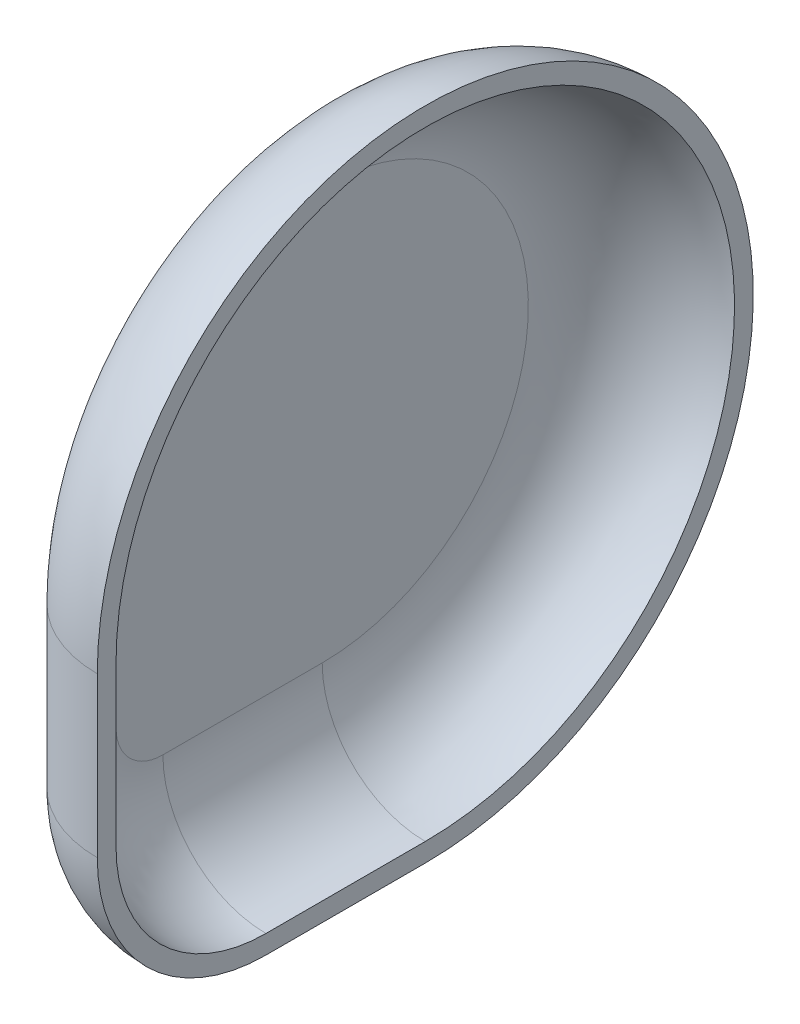
ISO-10303-21;
HEADER;
FILE_DESCRIPTION(('STEP AP214'),'2;1');
FILE_NAME('part.step','',(''),(''),'','','');
FILE_SCHEMA(('AUTOMOTIVE_DESIGN { 1 0 10303 214 1 1 1 1 }'));
ENDSEC;
DATA;
#1=APPLICATION_CONTEXT('core data for automotive mechanical design processes');
#2=APPLICATION_PROTOCOL_DEFINITION('international standard','automotive_design',2000,#1);
#3=PRODUCT_CONTEXT('',#1,'mechanical');
#4=PRODUCT('Part','Part','',(#3));
#5=PRODUCT_RELATED_PRODUCT_CATEGORY('part','',(#4));
#6=PRODUCT_DEFINITION_FORMATION('','',#4);
#7=PRODUCT_DEFINITION_CONTEXT('part definition',#1,'design');
#8=PRODUCT_DEFINITION('design','',#6,#7);
#9=PRODUCT_DEFINITION_SHAPE('','',#8);
#10=(LENGTH_UNIT() NAMED_UNIT(*) SI_UNIT(.MILLI.,.METRE.));
#11=(NAMED_UNIT(*) PLANE_ANGLE_UNIT() SI_UNIT($,.RADIAN.));
#12=(NAMED_UNIT(*) SI_UNIT($,.STERADIAN.) SOLID_ANGLE_UNIT());
#13=UNCERTAINTY_MEASURE_WITH_UNIT(LENGTH_MEASURE(1.E-05),#10,'distance_accuracy_value','');
#14=(GEOMETRIC_REPRESENTATION_CONTEXT(3) GLOBAL_UNCERTAINTY_ASSIGNED_CONTEXT((#13)) GLOBAL_UNIT_ASSIGNED_CONTEXT((#10,
#11,#12)) REPRESENTATION_CONTEXT('',''));
#15=CARTESIAN_POINT('',(0.,0.,0.));
#16=DIRECTION('',(0.,0.,1.));
#17=DIRECTION('',(1.,0.,0.));
#18=AXIS2_PLACEMENT_3D('',#15,#16,#17);
#19=CARTESIAN_POINT('',(13.,0.,0.));
#20=DIRECTION('',(1.,0.,0.));
#21=DIRECTION('',(0.,0.,-1.));
#22=AXIS2_PLACEMENT_3D('',#19,#20,#21);
#23=PLANE('',#22);
#24=CARTESIAN_POINT('',(13.,0.,0.));
#25=DIRECTION('',(1.,0.,0.));
#26=DIRECTION('',(0.,0.,-1.));
#27=AXIS2_PLACEMENT_3D('',#24,#25,#26);
#28=CIRCLE('',#27,33.);
#29=CARTESIAN_POINT('',(13.,-33.,0.));
#30=VERTEX_POINT('',#29);
#31=CARTESIAN_POINT('',(13.,0.,33.));
#32=VERTEX_POINT('',#31);
#33=EDGE_CURVE('E131',#30,#32,#28,.T.);
#34=ORIENTED_EDGE('',*,*,#33,.F.);
#35=DIRECTION('',(0.,0.,-1.));
#36=VECTOR('',#35,1.);
#37=CARTESIAN_POINT('',(13.,-33.,16.9999999999999));
#38=LINE('',#37,#36);
#39=CARTESIAN_POINT('',(13.,-33.,16.9999999999999));
#40=VERTEX_POINT('',#39);
#41=EDGE_CURVE('E113',#40,#30,#38,.T.);
#42=ORIENTED_EDGE('',*,*,#41,.F.);
#43=CARTESIAN_POINT('',(13.,-17.,17.));
#44=DIRECTION('',(1.,0.,0.));
#45=DIRECTION('',(0.,0.,-1.));
#46=AXIS2_PLACEMENT_3D('',#43,#44,#45);
#47=CIRCLE('',#46,16.);
#48=CARTESIAN_POINT('',(13.,-16.9999999999999,33.));
#49=VERTEX_POINT('',#48);
#50=EDGE_CURVE('E130',#49,#40,#47,.T.);
#51=ORIENTED_EDGE('',*,*,#50,.F.);
#52=DIRECTION('',(0.,-1.,0.));
#53=VECTOR('',#52,1.);
#54=CARTESIAN_POINT('',(13.,0.,33.));
#55=LINE('',#54,#53);
#56=EDGE_CURVE('E128',#32,#49,#55,.T.);
#57=ORIENTED_EDGE('',*,*,#56,.F.);
#58=EDGE_LOOP('',(#34,#42,#51,#57));
#59=FACE_BOUND('',#58,.T.);
#60=CARTESIAN_POINT('',(13.,0.,0.));
#61=DIRECTION('',(1.,0.,0.));
#62=DIRECTION('',(0.,0.,-1.));
#63=AXIS2_PLACEMENT_3D('',#60,#61,#62);
#64=CIRCLE('',#63,35.);
#65=CARTESIAN_POINT('',(13.,-35.,0.));
#66=VERTEX_POINT('',#65);
#67=CARTESIAN_POINT('',(13.,0.,35.));
#68=VERTEX_POINT('',#67);
#69=EDGE_CURVE('E136',#66,#68,#64,.T.);
#70=ORIENTED_EDGE('',*,*,#69,.T.);
#71=DIRECTION('',(0.,-1.,0.));
#72=VECTOR('',#71,1.);
#73=CARTESIAN_POINT('',(13.,-16.9999999999999,35.));
#74=LINE('',#73,#72);
#75=CARTESIAN_POINT('',(13.,-16.9999999999999,35.));
#76=VERTEX_POINT('',#75);
#77=EDGE_CURVE('E138',#68,#76,#74,.T.);
#78=ORIENTED_EDGE('',*,*,#77,.T.);
#79=CARTESIAN_POINT('',(13.,-17.,17.));
#80=DIRECTION('',(1.,0.,0.));
#81=DIRECTION('',(0.,0.,-1.));
#82=AXIS2_PLACEMENT_3D('',#79,#80,#81);
#83=CIRCLE('',#82,18.);
#84=CARTESIAN_POINT('',(13.,-35.,16.9999999999999));
#85=VERTEX_POINT('',#84);
#86=EDGE_CURVE('E140',#76,#85,#83,.T.);
#87=ORIENTED_EDGE('',*,*,#86,.T.);
#88=DIRECTION('',(0.,0.,-1.));
#89=VECTOR('',#88,1.);
#90=CARTESIAN_POINT('',(13.,-35.,0.));
#91=LINE('',#90,#89);
#92=EDGE_CURVE('E142',#85,#66,#91,.T.);
#93=ORIENTED_EDGE('',*,*,#92,.T.);
#94=EDGE_LOOP('',(#70,#78,#87,#93));
#95=FACE_BOUND('',#94,.T.);
#96=ADVANCED_FACE('F33',(#59,#95),#23,.T.);
#97=CARTESIAN_POINT('',(0.,0.,0.));
#98=DIRECTION('',(1.,0.,0.));
#99=DIRECTION('',(0.,0.,-1.));
#100=AXIS2_PLACEMENT_3D('',#97,#98,#99);
#101=PLANE('',#100);
#102=CARTESIAN_POINT('',(0.,0.,0.));
#103=DIRECTION('',(1.,0.,0.));
#104=DIRECTION('',(0.,0.,-1.));
#105=AXIS2_PLACEMENT_3D('',#102,#103,#104);
#106=CIRCLE('',#105,22.);
#107=CARTESIAN_POINT('',(0.,0.,22.));
#108=VERTEX_POINT('',#107);
#109=CARTESIAN_POINT('',(0.,-22.,0.));
#110=VERTEX_POINT('',#109);
#111=EDGE_CURVE('E145',#108,#110,#106,.F.);
#112=ORIENTED_EDGE('',*,*,#111,.T.);
#113=DIRECTION('',(0.,0.,-1.));
#114=VECTOR('',#113,1.);
#115=CARTESIAN_POINT('',(0.,-22.,0.));
#116=LINE('',#115,#114);
#117=CARTESIAN_POINT('',(0.,-22.,16.9999999999999));
#118=VERTEX_POINT('',#117);
#119=EDGE_CURVE('E11',#110,#118,#116,.F.);
#120=ORIENTED_EDGE('',*,*,#119,.T.);
#121=CARTESIAN_POINT('',(0.,-17.,17.));
#122=DIRECTION('',(1.,0.,0.));
#123=DIRECTION('',(0.,0.,-1.));
#124=AXIS2_PLACEMENT_3D('',#121,#122,#123);
#125=CIRCLE('',#124,5.);
#126=CARTESIAN_POINT('',(0.,-17.,22.));
#127=VERTEX_POINT('',#126);
#128=EDGE_CURVE('E42',#118,#127,#125,.F.);
#129=ORIENTED_EDGE('',*,*,#128,.T.);
#130=DIRECTION('',(0.,-1.,0.));
#131=VECTOR('',#130,1.);
#132=CARTESIAN_POINT('',(0.,0.,22.));
#133=LINE('',#132,#131);
#134=EDGE_CURVE('E147',#127,#108,#133,.F.);
#135=ORIENTED_EDGE('',*,*,#134,.T.);
#136=EDGE_LOOP('',(#112,#120,#129,#135));
#137=FACE_BOUND('',#136,.T.);
#138=ADVANCED_FACE('F166',(#137),#101,.F.);
#139=CARTESIAN_POINT('',(13.,-16.9999999999999,22.));
#140=DIRECTION('',(0.,-1.,0.));
#141=DIRECTION('',(0.,0.,-1.));
#142=AXIS2_PLACEMENT_3D('',#139,#140,#141);
#143=CYLINDRICAL_SURFACE('',#142,13.);
#144=CARTESIAN_POINT('',(13.,0.,22.));
#145=DIRECTION('',(0.,1.,0.));
#146=DIRECTION('',(0.,0.,1.));
#147=AXIS2_PLACEMENT_3D('',#144,#145,#146);
#148=CIRCLE('',#147,13.);
#149=EDGE_CURVE('E151',#108,#68,#148,.T.);
#150=ORIENTED_EDGE('',*,*,#149,.F.);
#151=ORIENTED_EDGE('',*,*,#134,.F.);
#152=CARTESIAN_POINT('',(13.,-16.9999999999999,22.));
#153=DIRECTION('',(0.,-1.,0.));
#154=DIRECTION('',(1.,0.,0.));
#155=AXIS2_PLACEMENT_3D('',#152,#153,#154);
#156=CIRCLE('',#155,13.);
#157=EDGE_CURVE('E37',#76,#127,#156,.T.);
#158=ORIENTED_EDGE('',*,*,#157,.F.);
#159=ORIENTED_EDGE('',*,*,#77,.F.);
#160=EDGE_LOOP('',(#150,#151,#158,#159));
#161=FACE_BOUND('',#160,.T.);
#162=ADVANCED_FACE('F35',(#161),#143,.T.);
#163=CARTESIAN_POINT('',(13.,-17.,17.));
#164=DIRECTION('',(1.,0.,0.));
#165=DIRECTION('',(0.,0.,-1.));
#166=AXIS2_PLACEMENT_3D('',#163,#164,#165);
#167=DEGENERATE_TOROIDAL_SURFACE('',#166,5.,13.,.T.);
#168=ORIENTED_EDGE('',*,*,#157,.T.);
#169=ORIENTED_EDGE('',*,*,#128,.F.);
#170=CARTESIAN_POINT('',(13.,-22.,17.));
#171=DIRECTION('',(0.,0.,-1.));
#172=DIRECTION('',(0.,1.,0.));
#173=AXIS2_PLACEMENT_3D('',#170,#171,#172);
#174=CIRCLE('',#173,13.);
#175=EDGE_CURVE('E58',#85,#118,#174,.T.);
#176=ORIENTED_EDGE('',*,*,#175,.F.);
#177=ORIENTED_EDGE('',*,*,#86,.F.);
#178=EDGE_LOOP('',(#168,#169,#176,#177));
#179=FACE_BOUND('',#178,.T.);
#180=ADVANCED_FACE('F161',(#179),#167,.T.);
#181=CARTESIAN_POINT('',(13.,0.,0.));
#182=DIRECTION('',(1.,0.,0.));
#183=DIRECTION('',(0.,0.,-1.));
#184=AXIS2_PLACEMENT_3D('',#181,#182,#183);
#185=TOROIDAL_SURFACE('',#184,22.,13.);
#186=ORIENTED_EDGE('',*,*,#149,.T.);
#187=ORIENTED_EDGE('',*,*,#69,.F.);
#188=CARTESIAN_POINT('',(13.,-22.,0.));
#189=DIRECTION('',(0.,0.,1.));
#190=DIRECTION('',(1.,0.,0.));
#191=AXIS2_PLACEMENT_3D('',#188,#189,#190);
#192=CIRCLE('',#191,13.);
#193=EDGE_CURVE('E119',#110,#66,#192,.T.);
#194=ORIENTED_EDGE('',*,*,#193,.F.);
#195=ORIENTED_EDGE('',*,*,#111,.F.);
#196=EDGE_LOOP('',(#186,#187,#194,#195));
#197=FACE_BOUND('',#196,.T.);
#198=ADVANCED_FACE('F169',(#197),#185,.T.);
#199=CARTESIAN_POINT('',(13.,-22.,0.));
#200=DIRECTION('',(0.,0.,-1.));
#201=DIRECTION('',(-1.,0.,0.));
#202=AXIS2_PLACEMENT_3D('',#199,#200,#201);
#203=CYLINDRICAL_SURFACE('',#202,13.);
#204=ORIENTED_EDGE('',*,*,#175,.T.);
#205=ORIENTED_EDGE('',*,*,#119,.F.);
#206=ORIENTED_EDGE('',*,*,#193,.T.);
#207=ORIENTED_EDGE('',*,*,#92,.F.);
#208=EDGE_LOOP('',(#204,#205,#206,#207));
#209=FACE_BOUND('',#208,.T.);
#210=ADVANCED_FACE('F168',(#209),#203,.T.);
#211=CARTESIAN_POINT('',(2.,0.,0.));
#212=DIRECTION('',(1.,0.,0.));
#213=DIRECTION('',(0.,0.,-1.));
#214=AXIS2_PLACEMENT_3D('',#211,#212,#213);
#215=PLANE('',#214);
#216=CARTESIAN_POINT('',(2.,0.,0.));
#217=DIRECTION('',(1.,0.,0.));
#218=DIRECTION('',(0.,0.,-1.));
#219=AXIS2_PLACEMENT_3D('',#216,#217,#218);
#220=CIRCLE('',#219,22.);
#221=CARTESIAN_POINT('',(2.,0.,22.));
#222=VERTEX_POINT('',#221);
#223=CARTESIAN_POINT('',(2.,-22.,0.));
#224=VERTEX_POINT('',#223);
#225=EDGE_CURVE('E103',#222,#224,#220,.F.);
#226=ORIENTED_EDGE('',*,*,#225,.F.);
#227=DIRECTION('',(0.,1.,0.));
#228=VECTOR('',#227,1.);
#229=CARTESIAN_POINT('',(2.,0.,22.));
#230=LINE('',#229,#228);
#231=CARTESIAN_POINT('',(2.,-17.,22.));
#232=VERTEX_POINT('',#231);
#233=EDGE_CURVE('E112',#232,#222,#230,.T.);
#234=ORIENTED_EDGE('',*,*,#233,.F.);
#235=CARTESIAN_POINT('',(2.,-17.,17.));
#236=DIRECTION('',(1.,0.,0.));
#237=DIRECTION('',(0.,0.,-1.));
#238=AXIS2_PLACEMENT_3D('',#235,#236,#237);
#239=CIRCLE('',#238,5.);
#240=CARTESIAN_POINT('',(2.,-22.,16.9999999999999));
#241=VERTEX_POINT('',#240);
#242=EDGE_CURVE('E118',#241,#232,#239,.F.);
#243=ORIENTED_EDGE('',*,*,#242,.F.);
#244=DIRECTION('',(0.,0.,-1.));
#245=VECTOR('',#244,1.);
#246=CARTESIAN_POINT('',(2.,-22.,0.));
#247=LINE('',#246,#245);
#248=EDGE_CURVE('E116',#224,#241,#247,.F.);
#249=ORIENTED_EDGE('',*,*,#248,.F.);
#250=EDGE_LOOP('',(#226,#234,#243,#249));
#251=FACE_BOUND('',#250,.T.);
#252=ADVANCED_FACE('F117',(#251),#215,.T.);
#253=CARTESIAN_POINT('',(13.,-16.9999999999999,22.));
#254=DIRECTION('',(0.,-1.,0.));
#255=DIRECTION('',(0.,0.,-1.));
#256=AXIS2_PLACEMENT_3D('',#253,#254,#255);
#257=CYLINDRICAL_SURFACE('',#256,11.);
#258=CARTESIAN_POINT('',(13.,0.,22.));
#259=DIRECTION('',(0.,1.,0.));
#260=DIRECTION('',(0.,0.,1.));
#261=AXIS2_PLACEMENT_3D('',#258,#259,#260);
#262=CIRCLE('',#261,11.);
#263=EDGE_CURVE('E109',#222,#32,#262,.T.);
#264=ORIENTED_EDGE('',*,*,#263,.T.);
#265=ORIENTED_EDGE('',*,*,#56,.T.);
#266=CARTESIAN_POINT('',(13.,-17.,22.));
#267=DIRECTION('',(0.,1.,0.));
#268=DIRECTION('',(0.,0.,1.));
#269=AXIS2_PLACEMENT_3D('',#266,#267,#268);
#270=CIRCLE('',#269,11.);
#271=EDGE_CURVE('E135',#49,#232,#270,.F.);
#272=ORIENTED_EDGE('',*,*,#271,.T.);
#273=ORIENTED_EDGE('',*,*,#233,.T.);
#274=EDGE_LOOP('',(#264,#265,#272,#273));
#275=FACE_BOUND('',#274,.T.);
#276=ADVANCED_FACE('F223',(#275),#257,.F.);
#277=CARTESIAN_POINT('',(13.,-17.,17.));
#278=DIRECTION('',(1.,0.,0.));
#279=DIRECTION('',(0.,0.,-1.));
#280=AXIS2_PLACEMENT_3D('',#277,#278,#279);
#281=DEGENERATE_TOROIDAL_SURFACE('',#280,5.,11.,.T.);
#282=ORIENTED_EDGE('',*,*,#271,.F.);
#283=ORIENTED_EDGE('',*,*,#50,.T.);
#284=CARTESIAN_POINT('',(13.,-22.,16.9999999999999));
#285=DIRECTION('',(0.,0.,-1.));
#286=DIRECTION('',(-1.,0.,0.));
#287=AXIS2_PLACEMENT_3D('',#284,#285,#286);
#288=CIRCLE('',#287,11.);
#289=EDGE_CURVE('E50',#40,#241,#288,.T.);
#290=ORIENTED_EDGE('',*,*,#289,.T.);
#291=ORIENTED_EDGE('',*,*,#242,.T.);
#292=EDGE_LOOP('',(#282,#283,#290,#291));
#293=FACE_BOUND('',#292,.T.);
#294=ADVANCED_FACE('F231',(#293),#281,.F.);
#295=CARTESIAN_POINT('',(13.,0.,0.));
#296=DIRECTION('',(1.,0.,0.));
#297=DIRECTION('',(0.,0.,-1.));
#298=AXIS2_PLACEMENT_3D('',#295,#296,#297);
#299=TOROIDAL_SURFACE('',#298,22.,11.);
#300=ORIENTED_EDGE('',*,*,#263,.F.);
#301=ORIENTED_EDGE('',*,*,#225,.T.);
#302=CARTESIAN_POINT('',(13.,-22.,0.));
#303=DIRECTION('',(0.,0.,-1.));
#304=DIRECTION('',(-1.,0.,0.));
#305=AXIS2_PLACEMENT_3D('',#302,#303,#304);
#306=CIRCLE('',#305,11.);
#307=EDGE_CURVE('E107',#224,#30,#306,.F.);
#308=ORIENTED_EDGE('',*,*,#307,.T.);
#309=ORIENTED_EDGE('',*,*,#33,.T.);
#310=EDGE_LOOP('',(#300,#301,#308,#309));
#311=FACE_BOUND('',#310,.T.);
#312=ADVANCED_FACE('F105',(#311),#299,.F.);
#313=CARTESIAN_POINT('',(13.,-22.,0.));
#314=DIRECTION('',(0.,0.,-1.));
#315=DIRECTION('',(-1.,0.,0.));
#316=AXIS2_PLACEMENT_3D('',#313,#314,#315);
#317=CYLINDRICAL_SURFACE('',#316,11.);
#318=ORIENTED_EDGE('',*,*,#289,.F.);
#319=ORIENTED_EDGE('',*,*,#41,.T.);
#320=ORIENTED_EDGE('',*,*,#307,.F.);
#321=ORIENTED_EDGE('',*,*,#248,.T.);
#322=EDGE_LOOP('',(#318,#319,#320,#321));
#323=FACE_BOUND('',#322,.T.);
#324=ADVANCED_FACE('F121',(#323),#317,.F.);
#325=CLOSED_SHELL('',(#96,#138,#162,#180,#198,#210,#252,#276,#294,#312,#324));
#326=MANIFOLD_SOLID_BREP('B2',#325);
#327=ADVANCED_BREP_SHAPE_REPRESENTATION('',(#18,#326),#14);
#328=SHAPE_DEFINITION_REPRESENTATION(#9,#327);
ENDSEC;
END-ISO-10303-21;
